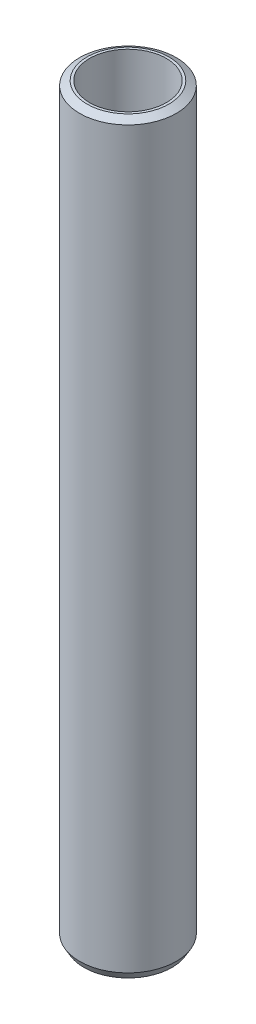
ISO-10303-21;
HEADER;
FILE_DESCRIPTION(('STEP AP214'),'2;1');
FILE_NAME('part.step','',(''),(''),'','','');
FILE_SCHEMA(('AUTOMOTIVE_DESIGN { 1 0 10303 214 1 1 1 1 }'));
ENDSEC;
DATA;
#1=APPLICATION_CONTEXT('core data for automotive mechanical design processes');
#2=APPLICATION_PROTOCOL_DEFINITION('international standard','automotive_design',2000,#1);
#3=PRODUCT_CONTEXT('',#1,'mechanical');
#4=PRODUCT('Part','Part','',(#3));
#5=PRODUCT_RELATED_PRODUCT_CATEGORY('part','',(#4));
#6=PRODUCT_DEFINITION_FORMATION('','',#4);
#7=PRODUCT_DEFINITION_CONTEXT('part definition',#1,'design');
#8=PRODUCT_DEFINITION('design','',#6,#7);
#9=PRODUCT_DEFINITION_SHAPE('','',#8);
#10=(LENGTH_UNIT() NAMED_UNIT(*) SI_UNIT(.MILLI.,.METRE.));
#11=(NAMED_UNIT(*) PLANE_ANGLE_UNIT() SI_UNIT($,.RADIAN.));
#12=(NAMED_UNIT(*) SI_UNIT($,.STERADIAN.) SOLID_ANGLE_UNIT());
#13=UNCERTAINTY_MEASURE_WITH_UNIT(LENGTH_MEASURE(1.E-05),#10,'distance_accuracy_value','');
#14=(GEOMETRIC_REPRESENTATION_CONTEXT(3) GLOBAL_UNCERTAINTY_ASSIGNED_CONTEXT((#13)) GLOBAL_UNIT_ASSIGNED_CONTEXT((#10,
#11,#12)) REPRESENTATION_CONTEXT('',''));
#15=CARTESIAN_POINT('',(0.,0.,0.));
#16=DIRECTION('',(0.,0.,1.));
#17=DIRECTION('',(1.,0.,0.));
#18=AXIS2_PLACEMENT_3D('',#15,#16,#17);
#19=CARTESIAN_POINT('',(0.,540.011191513002,0.));
#20=DIRECTION('',(0.,-1.,0.));
#21=DIRECTION('',(0.,0.,-1.));
#22=AXIS2_PLACEMENT_3D('',#19,#20,#21);
#23=CYLINDRICAL_SURFACE('',#22,35.);
#24=CARTESIAN_POINT('',(0.,536.899002985171,0.));
#25=DIRECTION('',(0.,1.,0.));
#26=DIRECTION('',(0.,0.,1.));
#27=AXIS2_PLACEMENT_3D('',#24,#25,#26);
#28=CIRCLE('',#27,35.);
#29=CARTESIAN_POINT('',(0.,536.899002985171,35.));
#30=VERTEX_POINT('',#29);
#31=EDGE_CURVE('E50',#30,#30,#28,.F.);
#32=ORIENTED_EDGE('',*,*,#31,.T.);
#33=EDGE_LOOP('',(#32));
#34=FACE_BOUND('',#33,.T.);
#35=CARTESIAN_POINT('',(0.,5.39536425784803,0.));
#36=DIRECTION('',(0.,1.,0.));
#37=DIRECTION('',(0.,0.,1.));
#38=AXIS2_PLACEMENT_3D('',#35,#36,#37);
#39=CIRCLE('',#38,35.);
#40=CARTESIAN_POINT('',(0.,5.39536425784803,35.));
#41=VERTEX_POINT('',#40);
#42=EDGE_CURVE('E51',#41,#41,#39,.T.);
#43=ORIENTED_EDGE('',*,*,#42,.T.);
#44=EDGE_LOOP('',(#43));
#45=FACE_BOUND('',#44,.T.);
#46=ADVANCED_FACE('F39',(#34,#45),#23,.T.);
#47=CARTESIAN_POINT('',(0.,540.011191513002,0.));
#48=DIRECTION('',(0.,1.,0.));
#49=DIRECTION('',(0.,0.,1.));
#50=AXIS2_PLACEMENT_3D('',#47,#48,#49);
#51=PLANE('',#50);
#52=CARTESIAN_POINT('',(0.,540.011191513002,0.));
#53=DIRECTION('',(0.,1.,0.));
#54=DIRECTION('',(0.,0.,1.));
#55=AXIS2_PLACEMENT_3D('',#52,#53,#54);
#56=CIRCLE('',#55,29.6046357421516);
#57=CARTESIAN_POINT('',(0.,540.011191513002,29.6046357421516));
#58=VERTEX_POINT('',#57);
#59=EDGE_CURVE('E54',#58,#58,#56,.T.);
#60=ORIENTED_EDGE('',*,*,#59,.T.);
#61=EDGE_LOOP('',(#60));
#62=FACE_BOUND('',#61,.T.);
#63=CARTESIAN_POINT('',(0.,540.011191513002,0.));
#64=DIRECTION('',(0.,1.,0.));
#65=DIRECTION('',(0.,0.,1.));
#66=AXIS2_PLACEMENT_3D('',#63,#64,#65);
#67=CIRCLE('',#66,27.7749885865152);
#68=CARTESIAN_POINT('',(0.,540.011191513002,27.7749885865152));
#69=VERTEX_POINT('',#68);
#70=EDGE_CURVE('E58',#69,#69,#67,.T.);
#71=ORIENTED_EDGE('',*,*,#70,.F.);
#72=EDGE_LOOP('',(#71));
#73=FACE_BOUND('',#72,.T.);
#74=ADVANCED_FACE('F69',(#62,#73),#51,.T.);
#75=CARTESIAN_POINT('',(0.,0.,0.));
#76=DIRECTION('',(0.,1.,0.));
#77=DIRECTION('',(0.,0.,1.));
#78=AXIS2_PLACEMENT_3D('',#75,#76,#77);
#79=PLANE('',#78);
#80=CARTESIAN_POINT('',(0.,0.,0.));
#81=DIRECTION('',(0.,1.,0.));
#82=DIRECTION('',(0.,0.,1.));
#83=AXIS2_PLACEMENT_3D('',#80,#81,#82);
#84=CIRCLE('',#83,31.8878114721697);
#85=CARTESIAN_POINT('',(0.,0.,31.8878114721697));
#86=VERTEX_POINT('',#85);
#87=EDGE_CURVE('E10',#86,#86,#84,.F.);
#88=ORIENTED_EDGE('',*,*,#87,.T.);
#89=EDGE_LOOP('',(#88));
#90=FACE_BOUND('',#89,.T.);
#91=CARTESIAN_POINT('',(0.,0.,0.));
#92=DIRECTION('',(0.,1.,0.));
#93=DIRECTION('',(0.,0.,1.));
#94=AXIS2_PLACEMENT_3D('',#91,#92,#93);
#95=CIRCLE('',#94,27.7749885865152);
#96=CARTESIAN_POINT('',(0.,0.,27.7749885865152));
#97=VERTEX_POINT('',#96);
#98=EDGE_CURVE('E63',#97,#97,#95,.T.);
#99=ORIENTED_EDGE('',*,*,#98,.T.);
#100=EDGE_LOOP('',(#99));
#101=FACE_BOUND('',#100,.T.);
#102=ADVANCED_FACE('F75',(#90,#101),#79,.F.);
#103=CARTESIAN_POINT('',(0.,540.011191513002,0.));
#104=DIRECTION('',(0.,-1.,0.));
#105=DIRECTION('',(0.,0.,-1.));
#106=AXIS2_PLACEMENT_3D('',#103,#104,#105);
#107=CYLINDRICAL_SURFACE('',#106,27.7749885865152);
#108=ORIENTED_EDGE('',*,*,#70,.T.);
#109=EDGE_LOOP('',(#108));
#110=FACE_BOUND('',#109,.T.);
#111=ORIENTED_EDGE('',*,*,#98,.F.);
#112=EDGE_LOOP('',(#111));
#113=FACE_BOUND('',#112,.T.);
#114=ADVANCED_FACE('F70',(#110,#113),#107,.F.);
#115=CARTESIAN_POINT('',(0.,540.011191513002,0.));
#116=DIRECTION('',(0.,-1.,0.));
#117=DIRECTION('',(0.,0.,-1.));
#118=AXIS2_PLACEMENT_3D('',#115,#116,#117);
#119=CONICAL_SURFACE('',#118,29.6046357421516,1.04759054412254);
#120=ORIENTED_EDGE('',*,*,#31,.F.);
#121=EDGE_LOOP('',(#120));
#122=FACE_BOUND('',#121,.T.);
#123=ORIENTED_EDGE('',*,*,#59,.F.);
#124=EDGE_LOOP('',(#123));
#125=FACE_BOUND('',#124,.T.);
#126=ADVANCED_FACE('F81',(#122,#125),#119,.T.);
#127=CARTESIAN_POINT('',(0.,5.39536425784803,0.));
#128=DIRECTION('',(0.,1.,0.));
#129=DIRECTION('',(0.,0.,1.));
#130=AXIS2_PLACEMENT_3D('',#127,#128,#129);
#131=CONICAL_SURFACE('',#130,35.,0.523205782672372);
#132=ORIENTED_EDGE('',*,*,#87,.F.);
#133=EDGE_LOOP('',(#132));
#134=FACE_BOUND('',#133,.T.);
#135=ORIENTED_EDGE('',*,*,#42,.F.);
#136=EDGE_LOOP('',(#135));
#137=FACE_BOUND('',#136,.T.);
#138=ADVANCED_FACE('F45',(#134,#137),#131,.T.);
#139=CLOSED_SHELL('',(#46,#74,#102,#114,#126,#138));
#140=MANIFOLD_SOLID_BREP('B2',#139);
#141=ADVANCED_BREP_SHAPE_REPRESENTATION('',(#18,#140),#14);
#142=SHAPE_DEFINITION_REPRESENTATION(#9,#141);
ENDSEC;
END-ISO-10303-21;
